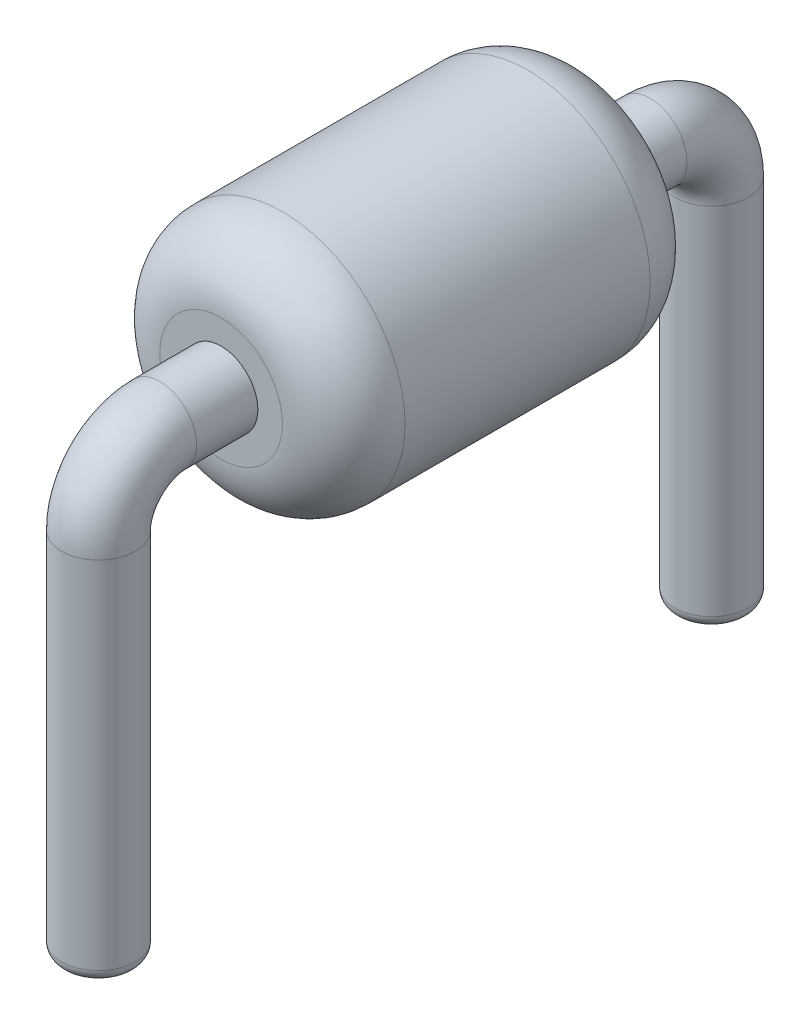
ISO-10303-21;
HEADER;
FILE_DESCRIPTION(('STEP AP214'),'2;1');
FILE_NAME('part.step','',(''),(''),'','','');
FILE_SCHEMA(('AUTOMOTIVE_DESIGN { 1 0 10303 214 1 1 1 1 }'));
ENDSEC;
DATA;
#1=APPLICATION_CONTEXT('core data for automotive mechanical design processes');
#2=APPLICATION_PROTOCOL_DEFINITION('international standard','automotive_design',2000,#1);
#3=PRODUCT_CONTEXT('',#1,'mechanical');
#4=PRODUCT('Part','Part','',(#3));
#5=PRODUCT_RELATED_PRODUCT_CATEGORY('part','',(#4));
#6=PRODUCT_DEFINITION_FORMATION('','',#4);
#7=PRODUCT_DEFINITION_CONTEXT('part definition',#1,'design');
#8=PRODUCT_DEFINITION('design','',#6,#7);
#9=PRODUCT_DEFINITION_SHAPE('','',#8);
#10=(LENGTH_UNIT() NAMED_UNIT(*) SI_UNIT(.MILLI.,.METRE.));
#11=(NAMED_UNIT(*) PLANE_ANGLE_UNIT() SI_UNIT($,.RADIAN.));
#12=(NAMED_UNIT(*) SI_UNIT($,.STERADIAN.) SOLID_ANGLE_UNIT());
#13=UNCERTAINTY_MEASURE_WITH_UNIT(LENGTH_MEASURE(1.E-05),#10,'distance_accuracy_value','');
#14=(GEOMETRIC_REPRESENTATION_CONTEXT(3) GLOBAL_UNCERTAINTY_ASSIGNED_CONTEXT((#13)) GLOBAL_UNIT_ASSIGNED_CONTEXT((#10,
#11,#12)) REPRESENTATION_CONTEXT('',''));
#15=CARTESIAN_POINT('',(0.,0.,0.));
#16=DIRECTION('',(0.,0.,1.));
#17=DIRECTION('',(1.,0.,0.));
#18=AXIS2_PLACEMENT_3D('',#15,#16,#17);
#19=CARTESIAN_POINT('',(0.,3.5,-0.5));
#20=DIRECTION('',(0.,0.,-1.));
#21=DIRECTION('',(-1.,0.,0.));
#22=AXIS2_PLACEMENT_3D('',#19,#20,#21);
#23=CYLINDRICAL_SURFACE('',#22,0.3);
#24=CARTESIAN_POINT('',(0.,3.5,-4.5));
#25=DIRECTION('',(0.,0.,-1.));
#26=DIRECTION('',(0.,1.,0.));
#27=AXIS2_PLACEMENT_3D('',#24,#25,#26);
#28=CIRCLE('',#27,0.3);
#29=CARTESIAN_POINT('',(0.,3.8,-4.5));
#30=VERTEX_POINT('',#29);
#31=EDGE_CURVE('E71',#30,#30,#28,.T.);
#32=ORIENTED_EDGE('',*,*,#31,.F.);
#33=EDGE_LOOP('',(#32));
#34=FACE_BOUND('',#33,.T.);
#35=CARTESIAN_POINT('',(0.,3.5,-4.));
#36=DIRECTION('',(0.,0.,1.));
#37=DIRECTION('',(1.,0.,0.));
#38=AXIS2_PLACEMENT_3D('',#35,#36,#37);
#39=CIRCLE('',#38,0.3);
#40=CARTESIAN_POINT('',(0.3,3.5,-4.));
#41=VERTEX_POINT('',#40);
#42=EDGE_CURVE('E80',#41,#41,#39,.T.);
#43=ORIENTED_EDGE('',*,*,#42,.F.);
#44=EDGE_LOOP('',(#43));
#45=FACE_BOUND('',#44,.T.);
#46=ADVANCED_FACE('F33',(#34,#45),#23,.T.);
#47=CARTESIAN_POINT('',(0.,3.,-5.));
#48=DIRECTION('',(0.,-1.,0.));
#49=DIRECTION('',(0.,0.,-1.));
#50=AXIS2_PLACEMENT_3D('',#47,#48,#49);
#51=CYLINDRICAL_SURFACE('',#50,0.3);
#52=CARTESIAN_POINT('',(0.,0.099999999999999,-5.));
#53=DIRECTION('',(0.,-1.,0.));
#54=DIRECTION('',(0.,0.,-1.));
#55=AXIS2_PLACEMENT_3D('',#52,#53,#54);
#56=CIRCLE('',#55,0.3);
#57=CARTESIAN_POINT('',(0.,0.099999999999999,-5.3));
#58=VERTEX_POINT('',#57);
#59=EDGE_CURVE('E44',#58,#58,#56,.F.);
#60=ORIENTED_EDGE('',*,*,#59,.T.);
#61=EDGE_LOOP('',(#60));
#62=FACE_BOUND('',#61,.T.);
#63=CARTESIAN_POINT('',(0.,3.,-5.));
#64=DIRECTION('',(0.,-1.,0.));
#65=DIRECTION('',(0.,0.,-1.));
#66=AXIS2_PLACEMENT_3D('',#63,#64,#65);
#67=CIRCLE('',#66,0.3);
#68=CARTESIAN_POINT('',(0.,3.,-5.3));
#69=VERTEX_POINT('',#68);
#70=EDGE_CURVE('E68',#69,#69,#67,.T.);
#71=ORIENTED_EDGE('',*,*,#70,.T.);
#72=EDGE_LOOP('',(#71));
#73=FACE_BOUND('',#72,.T.);
#74=ADVANCED_FACE('F87',(#62,#73),#51,.T.);
#75=CARTESIAN_POINT('',(0.,3.,-4.5));
#76=DIRECTION('',(-1.,0.,0.));
#77=DIRECTION('',(0.,0.,1.));
#78=AXIS2_PLACEMENT_3D('',#75,#76,#77);
#79=TOROIDAL_SURFACE('',#78,0.5,0.3);
#80=CARTESIAN_POINT('',(0.,3.,-4.5));
#81=DIRECTION('',(-1.,0.,0.));
#82=DIRECTION('',(0.,0.,1.));
#83=AXIS2_PLACEMENT_3D('',#80,#81,#82);
#84=CIRCLE('',#83,0.799999999999999);
#85=EDGE_CURVE('',#30,#69,#84,.T.);
#86=ORIENTED_EDGE('',*,*,#31,.T.);
#87=ORIENTED_EDGE('',*,*,#70,.F.);
#88=ORIENTED_EDGE('',*,*,#85,.T.);
#89=ORIENTED_EDGE('',*,*,#85,.F.);
#90=EDGE_LOOP('',(#86,#88,#87,#89));
#91=FACE_BOUND('',#90,.T.);
#92=ADVANCED_FACE('F94',(#91),#79,.T.);
#93=CARTESIAN_POINT('',(0.,0.,-5.));
#94=DIRECTION('',(0.,-1.,0.));
#95=DIRECTION('',(0.,0.,-1.));
#96=AXIS2_PLACEMENT_3D('',#93,#94,#95);
#97=PLANE('',#96);
#98=CARTESIAN_POINT('',(0.,0.,-5.));
#99=DIRECTION('',(0.,-1.,0.));
#100=DIRECTION('',(0.,0.,-1.));
#101=AXIS2_PLACEMENT_3D('',#98,#99,#100);
#102=CIRCLE('',#101,0.2);
#103=CARTESIAN_POINT('',(0.,0.,-5.2));
#104=VERTEX_POINT('',#103);
#105=EDGE_CURVE('E48',#104,#104,#102,.T.);
#106=ORIENTED_EDGE('',*,*,#105,.T.);
#107=EDGE_LOOP('',(#106));
#108=FACE_BOUND('',#107,.T.);
#109=ADVANCED_FACE('F134',(#108),#97,.T.);
#110=CARTESIAN_POINT('',(0.,3.5,-4.));
#111=DIRECTION('',(0.,0.,1.));
#112=DIRECTION('',(1.,0.,0.));
#113=AXIS2_PLACEMENT_3D('',#110,#111,#112);
#114=CYLINDRICAL_SURFACE('',#113,1.);
#115=CARTESIAN_POINT('',(0.,3.5,-3.5));
#116=DIRECTION('',(0.,0.,1.));
#117=DIRECTION('',(1.,0.,0.));
#118=AXIS2_PLACEMENT_3D('',#115,#116,#117);
#119=CIRCLE('',#118,1.);
#120=CARTESIAN_POINT('',(1.,3.5,-3.5));
#121=VERTEX_POINT('',#120);
#122=EDGE_CURVE('E59',#121,#121,#119,.T.);
#123=ORIENTED_EDGE('',*,*,#122,.T.);
#124=EDGE_LOOP('',(#123));
#125=FACE_BOUND('',#124,.T.);
#126=CARTESIAN_POINT('',(0.,3.5,-1.5));
#127=DIRECTION('',(0.,0.,1.));
#128=DIRECTION('',(1.,0.,0.));
#129=AXIS2_PLACEMENT_3D('',#126,#127,#128);
#130=CIRCLE('',#129,1.);
#131=CARTESIAN_POINT('',(1.,3.5,-1.5));
#132=VERTEX_POINT('',#131);
#133=EDGE_CURVE('E62',#132,#132,#130,.F.);
#134=ORIENTED_EDGE('',*,*,#133,.T.);
#135=EDGE_LOOP('',(#134));
#136=FACE_BOUND('',#135,.T.);
#137=ADVANCED_FACE('F128',(#125,#136),#114,.T.);
#138=CARTESIAN_POINT('',(0.,3.5,-4.));
#139=DIRECTION('',(0.,0.,1.));
#140=DIRECTION('',(1.,0.,0.));
#141=AXIS2_PLACEMENT_3D('',#138,#139,#140);
#142=PLANE('',#141);
#143=CARTESIAN_POINT('',(0.,3.5,-4.));
#144=DIRECTION('',(0.,0.,1.));
#145=DIRECTION('',(1.,0.,0.));
#146=AXIS2_PLACEMENT_3D('',#143,#144,#145);
#147=CIRCLE('',#146,0.5);
#148=CARTESIAN_POINT('',(0.5,3.5,-4.));
#149=VERTEX_POINT('',#148);
#150=EDGE_CURVE('E56',#149,#149,#147,.F.);
#151=ORIENTED_EDGE('',*,*,#150,.T.);
#152=EDGE_LOOP('',(#151));
#153=FACE_BOUND('',#152,.T.);
#154=ORIENTED_EDGE('',*,*,#42,.T.);
#155=EDGE_LOOP('',(#154));
#156=FACE_BOUND('',#155,.T.);
#157=ADVANCED_FACE('F84',(#153,#156),#142,.F.);
#158=CARTESIAN_POINT('',(0.,3.5,-1.));
#159=DIRECTION('',(0.,0.,1.));
#160=DIRECTION('',(1.,0.,0.));
#161=AXIS2_PLACEMENT_3D('',#158,#159,#160);
#162=PLANE('',#161);
#163=CARTESIAN_POINT('',(0.,3.5,-1.));
#164=DIRECTION('',(0.,0.,1.));
#165=DIRECTION('',(1.,0.,0.));
#166=AXIS2_PLACEMENT_3D('',#163,#164,#165);
#167=CIRCLE('',#166,0.5);
#168=CARTESIAN_POINT('',(0.5,3.5,-1.));
#169=VERTEX_POINT('',#168);
#170=EDGE_CURVE('E53',#169,#169,#167,.T.);
#171=ORIENTED_EDGE('',*,*,#170,.T.);
#172=EDGE_LOOP('',(#171));
#173=FACE_BOUND('',#172,.T.);
#174=CARTESIAN_POINT('',(0.,3.5,-1.));
#175=DIRECTION('',(0.,0.,1.));
#176=DIRECTION('',(1.,0.,0.));
#177=AXIS2_PLACEMENT_3D('',#174,#175,#176);
#178=CIRCLE('',#177,0.3);
#179=CARTESIAN_POINT('',(0.3,3.5,-1.));
#180=VERTEX_POINT('',#179);
#181=EDGE_CURVE('E65',#180,#180,#178,.F.);
#182=ORIENTED_EDGE('',*,*,#181,.T.);
#183=EDGE_LOOP('',(#182));
#184=FACE_BOUND('',#183,.T.);
#185=ADVANCED_FACE('F118',(#173,#184),#162,.T.);
#186=CARTESIAN_POINT('',(0.,0.,0.));
#187=DIRECTION('',(0.,1.,0.));
#188=DIRECTION('',(0.,0.,1.));
#189=AXIS2_PLACEMENT_3D('',#186,#187,#188);
#190=PLANE('',#189);
#191=CARTESIAN_POINT('',(0.,0.,0.));
#192=DIRECTION('',(0.,1.,0.));
#193=DIRECTION('',(0.,0.,1.));
#194=AXIS2_PLACEMENT_3D('',#191,#192,#193);
#195=CIRCLE('',#194,0.2);
#196=CARTESIAN_POINT('',(0.,0.,0.2));
#197=VERTEX_POINT('',#196);
#198=EDGE_CURVE('E10',#197,#197,#195,.F.);
#199=ORIENTED_EDGE('',*,*,#198,.T.);
#200=EDGE_LOOP('',(#199));
#201=FACE_BOUND('',#200,.T.);
#202=ADVANCED_FACE('F120',(#201),#190,.F.);
#203=CARTESIAN_POINT('',(0.,3.,0.));
#204=DIRECTION('',(0.,-1.,0.));
#205=DIRECTION('',(0.,0.,-1.));
#206=AXIS2_PLACEMENT_3D('',#203,#204,#205);
#207=CYLINDRICAL_SURFACE('',#206,0.3);
#208=CARTESIAN_POINT('',(0.,0.0999999999999998,0.));
#209=DIRECTION('',(0.,1.,0.));
#210=DIRECTION('',(0.,0.,1.));
#211=AXIS2_PLACEMENT_3D('',#208,#209,#210);
#212=CIRCLE('',#211,0.3);
#213=CARTESIAN_POINT('',(0.,0.0999999999999998,0.3));
#214=VERTEX_POINT('',#213);
#215=EDGE_CURVE('E40',#214,#214,#212,.T.);
#216=ORIENTED_EDGE('',*,*,#215,.T.);
#217=EDGE_LOOP('',(#216));
#218=FACE_BOUND('',#217,.T.);
#219=CARTESIAN_POINT('',(0.,3.,0.));
#220=DIRECTION('',(0.,1.,0.));
#221=DIRECTION('',(0.,0.,1.));
#222=AXIS2_PLACEMENT_3D('',#219,#220,#221);
#223=CIRCLE('',#222,0.3);
#224=CARTESIAN_POINT('',(0.,3.,0.3));
#225=VERTEX_POINT('',#224);
#226=EDGE_CURVE('E77',#225,#225,#223,.T.);
#227=ORIENTED_EDGE('',*,*,#226,.F.);
#228=EDGE_LOOP('',(#227));
#229=FACE_BOUND('',#228,.T.);
#230=ADVANCED_FACE('F111',(#218,#229),#207,.T.);
#231=CARTESIAN_POINT('',(0.,3.,-0.5));
#232=DIRECTION('',(-1.,0.,0.));
#233=DIRECTION('',(0.,0.,1.));
#234=AXIS2_PLACEMENT_3D('',#231,#232,#233);
#235=TOROIDAL_SURFACE('',#234,0.5,0.3);
#236=CARTESIAN_POINT('',(0.,3.5,-0.5));
#237=DIRECTION('',(0.,0.,-1.));
#238=DIRECTION('',(0.,1.,0.));
#239=AXIS2_PLACEMENT_3D('',#236,#237,#238);
#240=CIRCLE('',#239,0.3);
#241=CARTESIAN_POINT('',(0.,3.8,-0.5));
#242=VERTEX_POINT('',#241);
#243=EDGE_CURVE('E74',#242,#242,#240,.T.);
#244=CARTESIAN_POINT('',(0.,3.,-0.5));
#245=DIRECTION('',(-1.,0.,0.));
#246=DIRECTION('',(0.,0.,1.));
#247=AXIS2_PLACEMENT_3D('',#244,#245,#246);
#248=CIRCLE('',#247,0.8);
#249=EDGE_CURVE('',#225,#242,#248,.T.);
#250=ORIENTED_EDGE('',*,*,#226,.T.);
#251=ORIENTED_EDGE('',*,*,#243,.F.);
#252=ORIENTED_EDGE('',*,*,#249,.T.);
#253=ORIENTED_EDGE('',*,*,#249,.F.);
#254=EDGE_LOOP('',(#250,#252,#251,#253));
#255=FACE_BOUND('',#254,.T.);
#256=ADVANCED_FACE('F102',(#255),#235,.T.);
#257=ORIENTED_EDGE('',*,*,#181,.F.);
#258=EDGE_LOOP('',(#257));
#259=FACE_BOUND('',#258,.T.);
#260=ORIENTED_EDGE('',*,*,#243,.T.);
#261=EDGE_LOOP('',(#260));
#262=FACE_BOUND('',#261,.T.);
#263=ADVANCED_FACE('F90',(#259,#262),#23,.T.);
#264=CARTESIAN_POINT('',(0.,3.5,-3.5));
#265=DIRECTION('',(0.,0.,1.));
#266=DIRECTION('',(1.,0.,0.));
#267=AXIS2_PLACEMENT_3D('',#264,#265,#266);
#268=DEGENERATE_TOROIDAL_SURFACE('',#267,0.5,0.5,.T.);
#269=ORIENTED_EDGE('',*,*,#150,.F.);
#270=EDGE_LOOP('',(#269));
#271=FACE_BOUND('',#270,.T.);
#272=ORIENTED_EDGE('',*,*,#122,.F.);
#273=EDGE_LOOP('',(#272));
#274=FACE_BOUND('',#273,.T.);
#275=ADVANCED_FACE('F101',(#271,#274),#268,.T.);
#276=CARTESIAN_POINT('',(0.,3.5,-1.5));
#277=DIRECTION('',(0.,0.,1.));
#278=DIRECTION('',(1.,0.,0.));
#279=AXIS2_PLACEMENT_3D('',#276,#277,#278);
#280=DEGENERATE_TOROIDAL_SURFACE('',#279,0.5,0.5,.T.);
#281=ORIENTED_EDGE('',*,*,#133,.F.);
#282=EDGE_LOOP('',(#281));
#283=FACE_BOUND('',#282,.T.);
#284=ORIENTED_EDGE('',*,*,#170,.F.);
#285=EDGE_LOOP('',(#284));
#286=FACE_BOUND('',#285,.T.);
#287=ADVANCED_FACE('F108',(#283,#286),#280,.T.);
#288=CARTESIAN_POINT('',(0.,0.099999999999999,-5.));
#289=DIRECTION('',(0.,-1.,0.));
#290=DIRECTION('',(0.,0.,-1.));
#291=AXIS2_PLACEMENT_3D('',#288,#289,#290);
#292=TOROIDAL_SURFACE('',#291,0.2,0.1);
#293=ORIENTED_EDGE('',*,*,#59,.F.);
#294=EDGE_LOOP('',(#293));
#295=FACE_BOUND('',#294,.T.);
#296=ORIENTED_EDGE('',*,*,#105,.F.);
#297=EDGE_LOOP('',(#296));
#298=FACE_BOUND('',#297,.T.);
#299=ADVANCED_FACE('F195',(#295,#298),#292,.T.);
#300=CARTESIAN_POINT('',(0.,0.0999999999999998,0.));
#301=DIRECTION('',(0.,1.,0.));
#302=DIRECTION('',(0.,0.,1.));
#303=AXIS2_PLACEMENT_3D('',#300,#301,#302);
#304=TOROIDAL_SURFACE('',#303,0.2,0.1);
#305=ORIENTED_EDGE('',*,*,#198,.F.);
#306=EDGE_LOOP('',(#305));
#307=FACE_BOUND('',#306,.T.);
#308=ORIENTED_EDGE('',*,*,#215,.F.);
#309=EDGE_LOOP('',(#308));
#310=FACE_BOUND('',#309,.T.);
#311=ADVANCED_FACE('F35',(#307,#310),#304,.T.);
#312=CLOSED_SHELL('',(#46,#74,#92,#109,#137,#157,#185,#202,#230,#256,#263,#275,#287,#299,#311));
#313=MANIFOLD_SOLID_BREP('B2',#312);
#314=ADVANCED_BREP_SHAPE_REPRESENTATION('',(#18,#313),#14);
#315=SHAPE_DEFINITION_REPRESENTATION(#9,#314);
ENDSEC;
END-ISO-10303-21;
